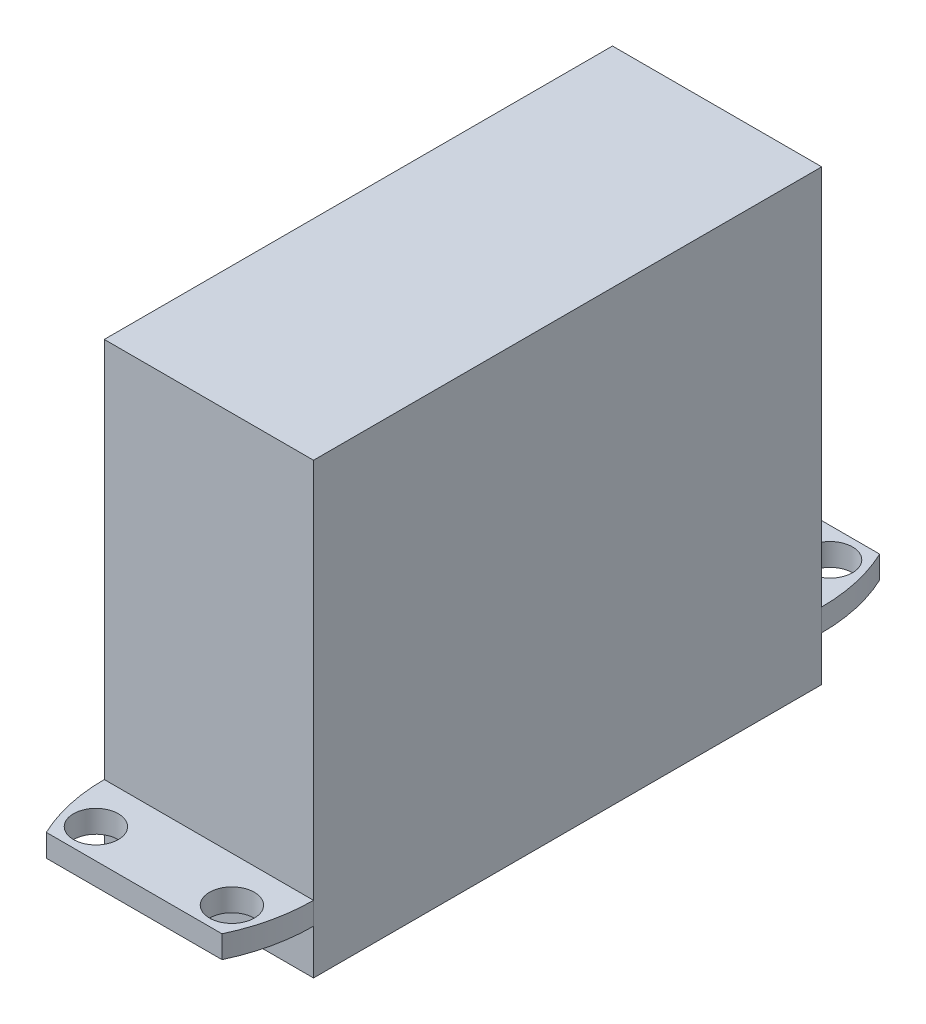
ISO-10303-21;
HEADER;
FILE_DESCRIPTION(('STEP AP214'),'2;1');
FILE_NAME('part.step','',(''),(''),'','','');
FILE_SCHEMA(('AUTOMOTIVE_DESIGN { 1 0 10303 214 1 1 1 1 }'));
ENDSEC;
DATA;
#1=APPLICATION_CONTEXT('core data for automotive mechanical design processes');
#2=APPLICATION_PROTOCOL_DEFINITION('international standard','automotive_design',2000,#1);
#3=PRODUCT_CONTEXT('',#1,'mechanical');
#4=PRODUCT('Part','Part','',(#3));
#5=PRODUCT_RELATED_PRODUCT_CATEGORY('part','',(#4));
#6=PRODUCT_DEFINITION_FORMATION('','',#4);
#7=PRODUCT_DEFINITION_CONTEXT('part definition',#1,'design');
#8=PRODUCT_DEFINITION('design','',#6,#7);
#9=PRODUCT_DEFINITION_SHAPE('','',#8);
#10=(LENGTH_UNIT() NAMED_UNIT(*) SI_UNIT(.MILLI.,.METRE.));
#11=(NAMED_UNIT(*) PLANE_ANGLE_UNIT() SI_UNIT($,.RADIAN.));
#12=(NAMED_UNIT(*) SI_UNIT($,.STERADIAN.) SOLID_ANGLE_UNIT());
#13=UNCERTAINTY_MEASURE_WITH_UNIT(LENGTH_MEASURE(1.E-05),#10,'distance_accuracy_value','');
#14=(GEOMETRIC_REPRESENTATION_CONTEXT(3) GLOBAL_UNCERTAINTY_ASSIGNED_CONTEXT((#13)) GLOBAL_UNIT_ASSIGNED_CONTEXT((#10,
#11,#12)) REPRESENTATION_CONTEXT('',''));
#15=CARTESIAN_POINT('',(0.,0.,0.));
#16=DIRECTION('',(0.,0.,1.));
#17=DIRECTION('',(1.,0.,0.));
#18=AXIS2_PLACEMENT_3D('',#15,#16,#17);
#19=CARTESIAN_POINT('',(0.,30.,-17.));
#20=DIRECTION('',(0.,0.,1.));
#21=DIRECTION('',(1.,0.,0.));
#22=AXIS2_PLACEMENT_3D('',#19,#20,#21);
#23=PLANE('',#22);
#24=DIRECTION('',(-1.,0.,0.));
#25=VECTOR('',#24,1.);
#26=CARTESIAN_POINT('',(0.,3.,-17.));
#27=LINE('',#26,#25);
#28=CARTESIAN_POINT('',(6.99999999999999,3.,-17.));
#29=VERTEX_POINT('',#28);
#30=CARTESIAN_POINT('',(-7.00000000000001,3.,-17.));
#31=VERTEX_POINT('',#30);
#32=EDGE_CURVE('E159',#29,#31,#27,.T.);
#33=ORIENTED_EDGE('',*,*,#32,.F.);
#34=DIRECTION('',(0.,-1.,0.));
#35=VECTOR('',#34,1.);
#36=CARTESIAN_POINT('',(6.99999999999999,30.,-17.));
#37=LINE('',#36,#35);
#38=CARTESIAN_POINT('',(6.99999999999999,0.,-17.));
#39=VERTEX_POINT('',#38);
#40=EDGE_CURVE('E249',#29,#39,#37,.T.);
#41=ORIENTED_EDGE('',*,*,#40,.T.);
#42=DIRECTION('',(-1.,0.,0.));
#43=VECTOR('',#42,1.);
#44=CARTESIAN_POINT('',(0.,0.,-17.));
#45=LINE('',#44,#43);
#46=CARTESIAN_POINT('',(-7.00000000000001,0.,-17.));
#47=VERTEX_POINT('',#46);
#48=EDGE_CURVE('E228',#39,#47,#45,.T.);
#49=ORIENTED_EDGE('',*,*,#48,.T.);
#50=DIRECTION('',(0.,-1.,0.));
#51=VECTOR('',#50,1.);
#52=CARTESIAN_POINT('',(-7.00000000000001,30.,-17.));
#53=LINE('',#52,#51);
#54=EDGE_CURVE('E235',#31,#47,#53,.T.);
#55=ORIENTED_EDGE('',*,*,#54,.F.);
#56=EDGE_LOOP('',(#33,#41,#49,#55));
#57=FACE_BOUND('',#56,.T.);
#58=ADVANCED_FACE('F38',(#57),#23,.F.);
#59=CARTESIAN_POINT('',(0.,30.,17.));
#60=DIRECTION('',(0.,0.,1.));
#61=DIRECTION('',(1.,0.,0.));
#62=AXIS2_PLACEMENT_3D('',#59,#60,#61);
#63=PLANE('',#62);
#64=DIRECTION('',(0.,-1.,0.));
#65=VECTOR('',#64,1.);
#66=CARTESIAN_POINT('',(6.99999999999999,30.,17.));
#67=LINE('',#66,#65);
#68=CARTESIAN_POINT('',(6.99999999999999,3.,17.));
#69=VERTEX_POINT('',#68);
#70=CARTESIAN_POINT('',(6.99999999999999,0.,17.));
#71=VERTEX_POINT('',#70);
#72=EDGE_CURVE('E252',#69,#71,#67,.T.);
#73=ORIENTED_EDGE('',*,*,#72,.F.);
#74=DIRECTION('',(-1.,0.,0.));
#75=VECTOR('',#74,1.);
#76=CARTESIAN_POINT('',(0.,3.,17.));
#77=LINE('',#76,#75);
#78=CARTESIAN_POINT('',(-7.00000000000001,3.,17.));
#79=VERTEX_POINT('',#78);
#80=EDGE_CURVE('E61',#69,#79,#77,.T.);
#81=ORIENTED_EDGE('',*,*,#80,.T.);
#82=DIRECTION('',(0.,-1.,0.));
#83=VECTOR('',#82,1.);
#84=CARTESIAN_POINT('',(-7.00000000000001,30.,17.));
#85=LINE('',#84,#83);
#86=CARTESIAN_POINT('',(-7.00000000000001,0.,17.));
#87=VERTEX_POINT('',#86);
#88=EDGE_CURVE('E46',#79,#87,#85,.T.);
#89=ORIENTED_EDGE('',*,*,#88,.T.);
#90=DIRECTION('',(-1.,0.,0.));
#91=VECTOR('',#90,1.);
#92=CARTESIAN_POINT('',(0.,0.,17.));
#93=LINE('',#92,#91);
#94=EDGE_CURVE('E238',#71,#87,#93,.T.);
#95=ORIENTED_EDGE('',*,*,#94,.F.);
#96=EDGE_LOOP('',(#73,#81,#89,#95));
#97=FACE_BOUND('',#96,.T.);
#98=ADVANCED_FACE('F265',(#97),#63,.T.);
#99=CARTESIAN_POINT('',(-7.00000000000001,30.,0.));
#100=DIRECTION('',(-1.,0.,0.));
#101=DIRECTION('',(0.,0.,1.));
#102=AXIS2_PLACEMENT_3D('',#99,#100,#101);
#103=PLANE('',#102);
#104=DIRECTION('',(0.,0.,-1.));
#105=VECTOR('',#104,1.);
#106=CARTESIAN_POINT('',(-7.00000000000001,0.,0.));
#107=LINE('',#106,#105);
#108=EDGE_CURVE('E221',#87,#47,#107,.T.);
#109=ORIENTED_EDGE('',*,*,#108,.F.);
#110=ORIENTED_EDGE('',*,*,#88,.F.);
#111=DIRECTION('',(0.,-1.,0.));
#112=VECTOR('',#111,1.);
#113=CARTESIAN_POINT('',(-7.00000000000001,4.5,17.));
#114=LINE('',#113,#112);
#115=CARTESIAN_POINT('',(-7.00000000000001,4.5,17.));
#116=VERTEX_POINT('',#115);
#117=EDGE_CURVE('E206',#116,#79,#114,.T.);
#118=ORIENTED_EDGE('',*,*,#117,.F.);
#119=CARTESIAN_POINT('',(-7.00000000000001,30.,17.));
#120=VERTEX_POINT('',#119);
#121=EDGE_CURVE('E11',#120,#116,#85,.T.);
#122=ORIENTED_EDGE('',*,*,#121,.F.);
#123=DIRECTION('',(0.,0.,-1.));
#124=VECTOR('',#123,1.);
#125=CARTESIAN_POINT('',(-7.00000000000001,30.,0.));
#126=LINE('',#125,#124);
#127=CARTESIAN_POINT('',(-7.00000000000001,30.,-17.));
#128=VERTEX_POINT('',#127);
#129=EDGE_CURVE('E224',#120,#128,#126,.T.);
#130=ORIENTED_EDGE('',*,*,#129,.T.);
#131=CARTESIAN_POINT('',(-7.00000000000001,4.5,-17.));
#132=VERTEX_POINT('',#131);
#133=EDGE_CURVE('E246',#128,#132,#53,.T.);
#134=ORIENTED_EDGE('',*,*,#133,.T.);
#135=DIRECTION('',(0.,-1.,0.));
#136=VECTOR('',#135,1.);
#137=CARTESIAN_POINT('',(-7.00000000000001,4.5,-17.));
#138=LINE('',#137,#136);
#139=EDGE_CURVE('E136',#132,#31,#138,.T.);
#140=ORIENTED_EDGE('',*,*,#139,.T.);
#141=ORIENTED_EDGE('',*,*,#54,.T.);
#142=EDGE_LOOP('',(#109,#110,#118,#122,#130,#134,#140,#141));
#143=FACE_BOUND('',#142,.T.);
#144=ADVANCED_FACE('F40',(#143),#103,.T.);
#145=DIRECTION('',(-1.,0.,0.));
#146=VECTOR('',#145,1.);
#147=CARTESIAN_POINT('',(0.,4.5,17.));
#148=LINE('',#147,#146);
#149=CARTESIAN_POINT('',(6.99999999999999,4.5,17.));
#150=VERTEX_POINT('',#149);
#151=EDGE_CURVE('E179',#150,#116,#148,.T.);
#152=ORIENTED_EDGE('',*,*,#151,.F.);
#153=CARTESIAN_POINT('',(6.99999999999999,30.,17.));
#154=VERTEX_POINT('',#153);
#155=EDGE_CURVE('E253',#154,#150,#67,.T.);
#156=ORIENTED_EDGE('',*,*,#155,.F.);
#157=DIRECTION('',(-1.,0.,0.));
#158=VECTOR('',#157,1.);
#159=CARTESIAN_POINT('',(0.,30.,17.));
#160=LINE('',#159,#158);
#161=EDGE_CURVE('E227',#154,#120,#160,.T.);
#162=ORIENTED_EDGE('',*,*,#161,.T.);
#163=ORIENTED_EDGE('',*,*,#121,.T.);
#164=EDGE_LOOP('',(#152,#156,#162,#163));
#165=FACE_BOUND('',#164,.T.);
#166=ADVANCED_FACE('F286',(#165),#63,.T.);
#167=CARTESIAN_POINT('',(6.99999999999999,30.,0.));
#168=DIRECTION('',(-1.,0.,0.));
#169=DIRECTION('',(0.,0.,1.));
#170=AXIS2_PLACEMENT_3D('',#167,#168,#169);
#171=PLANE('',#170);
#172=DIRECTION('',(0.,0.,-1.));
#173=VECTOR('',#172,1.);
#174=CARTESIAN_POINT('',(6.99999999999999,0.,0.));
#175=LINE('',#174,#173);
#176=EDGE_CURVE('E241',#71,#39,#175,.T.);
#177=ORIENTED_EDGE('',*,*,#176,.T.);
#178=ORIENTED_EDGE('',*,*,#40,.F.);
#179=DIRECTION('',(0.,-1.,0.));
#180=VECTOR('',#179,1.);
#181=CARTESIAN_POINT('',(6.99999999999999,4.5,-17.));
#182=LINE('',#181,#180);
#183=CARTESIAN_POINT('',(6.99999999999999,4.5,-17.));
#184=VERTEX_POINT('',#183);
#185=EDGE_CURVE('E171',#184,#29,#182,.T.);
#186=ORIENTED_EDGE('',*,*,#185,.F.);
#187=CARTESIAN_POINT('',(6.99999999999999,30.,-17.));
#188=VERTEX_POINT('',#187);
#189=EDGE_CURVE('E250',#188,#184,#37,.T.);
#190=ORIENTED_EDGE('',*,*,#189,.F.);
#191=DIRECTION('',(0.,0.,-1.));
#192=VECTOR('',#191,1.);
#193=CARTESIAN_POINT('',(6.99999999999999,30.,0.));
#194=LINE('',#193,#192);
#195=EDGE_CURVE('E231',#154,#188,#194,.T.);
#196=ORIENTED_EDGE('',*,*,#195,.F.);
#197=ORIENTED_EDGE('',*,*,#155,.T.);
#198=DIRECTION('',(0.,-1.,0.));
#199=VECTOR('',#198,1.);
#200=CARTESIAN_POINT('',(6.99999999999999,4.5,17.));
#201=LINE('',#200,#199);
#202=EDGE_CURVE('E193',#150,#69,#201,.T.);
#203=ORIENTED_EDGE('',*,*,#202,.T.);
#204=ORIENTED_EDGE('',*,*,#72,.T.);
#205=EDGE_LOOP('',(#177,#178,#186,#190,#196,#197,#203,#204));
#206=FACE_BOUND('',#205,.T.);
#207=ADVANCED_FACE('F258',(#206),#171,.F.);
#208=ORIENTED_EDGE('',*,*,#189,.T.);
#209=DIRECTION('',(-1.,0.,0.));
#210=VECTOR('',#209,1.);
#211=CARTESIAN_POINT('',(0.,4.5,-17.));
#212=LINE('',#211,#210);
#213=EDGE_CURVE('E146',#184,#132,#212,.T.);
#214=ORIENTED_EDGE('',*,*,#213,.T.);
#215=ORIENTED_EDGE('',*,*,#133,.F.);
#216=DIRECTION('',(-1.,0.,0.));
#217=VECTOR('',#216,1.);
#218=CARTESIAN_POINT('',(0.,30.,-17.));
#219=LINE('',#218,#217);
#220=EDGE_CURVE('E233',#188,#128,#219,.T.);
#221=ORIENTED_EDGE('',*,*,#220,.F.);
#222=EDGE_LOOP('',(#208,#214,#215,#221));
#223=FACE_BOUND('',#222,.T.);
#224=ADVANCED_FACE('F279',(#223),#23,.F.);
#225=CARTESIAN_POINT('',(0.,30.,0.));
#226=DIRECTION('',(0.,1.,0.));
#227=DIRECTION('',(0.,0.,1.));
#228=AXIS2_PLACEMENT_3D('',#225,#226,#227);
#229=PLANE('',#228);
#230=ORIENTED_EDGE('',*,*,#129,.F.);
#231=ORIENTED_EDGE('',*,*,#161,.F.);
#232=ORIENTED_EDGE('',*,*,#195,.T.);
#233=ORIENTED_EDGE('',*,*,#220,.T.);
#234=EDGE_LOOP('',(#230,#231,#232,#233));
#235=FACE_BOUND('',#234,.T.);
#236=ADVANCED_FACE('F283',(#235),#229,.T.);
#237=CARTESIAN_POINT('',(0.,0.,0.));
#238=DIRECTION('',(0.,1.,0.));
#239=DIRECTION('',(0.,0.,1.));
#240=AXIS2_PLACEMENT_3D('',#237,#238,#239);
#241=PLANE('',#240);
#242=CARTESIAN_POINT('',(0.,0.,9.99999999999997));
#243=DIRECTION('',(0.,1.,0.));
#244=DIRECTION('',(0.,0.,1.));
#245=AXIS2_PLACEMENT_3D('',#242,#243,#244);
#246=CIRCLE('',#245,2.5);
#247=CARTESIAN_POINT('',(0.,0.,12.5));
#248=VERTEX_POINT('',#247);
#249=EDGE_CURVE('E209',#248,#248,#246,.T.);
#250=ORIENTED_EDGE('',*,*,#249,.T.);
#251=EDGE_LOOP('',(#250));
#252=FACE_BOUND('',#251,.T.);
#253=ORIENTED_EDGE('',*,*,#108,.T.);
#254=ORIENTED_EDGE('',*,*,#48,.F.);
#255=ORIENTED_EDGE('',*,*,#176,.F.);
#256=ORIENTED_EDGE('',*,*,#94,.T.);
#257=EDGE_LOOP('',(#253,#254,#255,#256));
#258=FACE_BOUND('',#257,.T.);
#259=ADVANCED_FACE('F264',(#252,#258),#241,.F.);
#260=CARTESIAN_POINT('',(0.,12.,9.99999999999997));
#261=DIRECTION('',(0.,-1.,0.));
#262=DIRECTION('',(0.,0.,-1.));
#263=AXIS2_PLACEMENT_3D('',#260,#261,#262);
#264=CYLINDRICAL_SURFACE('',#263,2.5);
#265=CARTESIAN_POINT('',(0.,12.,9.99999999999997));
#266=DIRECTION('',(0.,1.,0.));
#267=DIRECTION('',(0.,0.,1.));
#268=AXIS2_PLACEMENT_3D('',#265,#266,#267);
#269=CIRCLE('',#268,2.5);
#270=CARTESIAN_POINT('',(0.,12.,12.5));
#271=VERTEX_POINT('',#270);
#272=EDGE_CURVE('E218',#271,#271,#269,.T.);
#273=ORIENTED_EDGE('',*,*,#272,.T.);
#274=EDGE_LOOP('',(#273));
#275=FACE_BOUND('',#274,.T.);
#276=ORIENTED_EDGE('',*,*,#249,.F.);
#277=EDGE_LOOP('',(#276));
#278=FACE_BOUND('',#277,.T.);
#279=ADVANCED_FACE('F511',(#275,#278),#264,.F.);
#280=CARTESIAN_POINT('',(0.,12.,9.99999999999997));
#281=DIRECTION('',(0.,1.,0.));
#282=DIRECTION('',(0.,0.,1.));
#283=AXIS2_PLACEMENT_3D('',#280,#281,#282);
#284=PLANE('',#283);
#285=ORIENTED_EDGE('',*,*,#272,.F.);
#286=EDGE_LOOP('',(#285));
#287=FACE_BOUND('',#286,.T.);
#288=ADVANCED_FACE('F314',(#287),#284,.F.);
#289=CARTESIAN_POINT('',(4.69999999999999,4.5,17.));
#290=DIRECTION('',(0.,-1.,0.));
#291=DIRECTION('',(0.,0.,-1.));
#292=AXIS2_PLACEMENT_3D('',#289,#290,#291);
#293=CYLINDRICAL_SURFACE('',#292,11.7);
#294=CARTESIAN_POINT('',(4.69999999999999,3.,17.));
#295=DIRECTION('',(0.,-1.,0.));
#296=DIRECTION('',(0.,0.,-1.));
#297=AXIS2_PLACEMENT_3D('',#294,#295,#296);
#298=CIRCLE('',#297,11.7);
#299=CARTESIAN_POINT('',(-5.87780695607554,3.,22.));
#300=VERTEX_POINT('',#299);
#301=EDGE_CURVE('E202',#79,#300,#298,.F.);
#302=ORIENTED_EDGE('',*,*,#301,.T.);
#303=DIRECTION('',(0.,-1.,0.));
#304=VECTOR('',#303,1.);
#305=CARTESIAN_POINT('',(-5.87780695607554,4.5,22.));
#306=LINE('',#305,#304);
#307=CARTESIAN_POINT('',(-5.87780695607554,4.5,22.));
#308=VERTEX_POINT('',#307);
#309=EDGE_CURVE('E210',#308,#300,#306,.T.);
#310=ORIENTED_EDGE('',*,*,#309,.F.);
#311=CARTESIAN_POINT('',(4.69999999999999,4.5,17.));
#312=DIRECTION('',(0.,-1.,0.));
#313=DIRECTION('',(0.,0.,-1.));
#314=AXIS2_PLACEMENT_3D('',#311,#312,#313);
#315=CIRCLE('',#314,11.7);
#316=EDGE_CURVE('E188',#116,#308,#315,.F.);
#317=ORIENTED_EDGE('',*,*,#316,.F.);
#318=ORIENTED_EDGE('',*,*,#117,.T.);
#319=EDGE_LOOP('',(#302,#310,#317,#318));
#320=FACE_BOUND('',#319,.T.);
#321=ADVANCED_FACE('F303',(#320),#293,.T.);
#322=CARTESIAN_POINT('',(0.,4.5,22.));
#323=DIRECTION('',(0.,0.,-1.));
#324=DIRECTION('',(-1.,0.,0.));
#325=AXIS2_PLACEMENT_3D('',#322,#323,#324);
#326=PLANE('',#325);
#327=DIRECTION('',(1.,0.,0.));
#328=VECTOR('',#327,1.);
#329=CARTESIAN_POINT('',(0.,3.,22.));
#330=LINE('',#329,#328);
#331=CARTESIAN_POINT('',(5.87780695607554,3.,22.));
#332=VERTEX_POINT('',#331);
#333=EDGE_CURVE('E200',#300,#332,#330,.T.);
#334=ORIENTED_EDGE('',*,*,#333,.T.);
#335=DIRECTION('',(0.,-1.,0.));
#336=VECTOR('',#335,1.);
#337=CARTESIAN_POINT('',(5.87780695607554,4.5,22.));
#338=LINE('',#337,#336);
#339=CARTESIAN_POINT('',(5.87780695607554,4.5,22.));
#340=VERTEX_POINT('',#339);
#341=EDGE_CURVE('E213',#340,#332,#338,.T.);
#342=ORIENTED_EDGE('',*,*,#341,.F.);
#343=DIRECTION('',(1.,0.,0.));
#344=VECTOR('',#343,1.);
#345=CARTESIAN_POINT('',(0.,4.5,22.));
#346=LINE('',#345,#344);
#347=EDGE_CURVE('E186',#308,#340,#346,.T.);
#348=ORIENTED_EDGE('',*,*,#347,.F.);
#349=ORIENTED_EDGE('',*,*,#309,.T.);
#350=EDGE_LOOP('',(#334,#342,#348,#349));
#351=FACE_BOUND('',#350,.T.);
#352=ADVANCED_FACE('F305',(#351),#326,.F.);
#353=CARTESIAN_POINT('',(-4.69999999999999,4.5,17.));
#354=DIRECTION('',(0.,-1.,0.));
#355=DIRECTION('',(0.,0.,-1.));
#356=AXIS2_PLACEMENT_3D('',#353,#354,#355);
#357=CYLINDRICAL_SURFACE('',#356,11.7);
#358=CARTESIAN_POINT('',(-4.69999999999999,3.,17.));
#359=DIRECTION('',(0.,-1.,0.));
#360=DIRECTION('',(0.,0.,-1.));
#361=AXIS2_PLACEMENT_3D('',#358,#359,#360);
#362=CIRCLE('',#361,11.7);
#363=EDGE_CURVE('E197',#332,#69,#362,.F.);
#364=ORIENTED_EDGE('',*,*,#363,.T.);
#365=ORIENTED_EDGE('',*,*,#202,.F.);
#366=CARTESIAN_POINT('',(-4.69999999999999,4.5,17.));
#367=DIRECTION('',(0.,-1.,0.));
#368=DIRECTION('',(0.,0.,-1.));
#369=AXIS2_PLACEMENT_3D('',#366,#367,#368);
#370=CIRCLE('',#369,11.7);
#371=EDGE_CURVE('E183',#340,#150,#370,.F.);
#372=ORIENTED_EDGE('',*,*,#371,.F.);
#373=ORIENTED_EDGE('',*,*,#341,.T.);
#374=EDGE_LOOP('',(#364,#365,#372,#373));
#375=FACE_BOUND('',#374,.T.);
#376=ADVANCED_FACE('F296',(#375),#357,.T.);
#377=CARTESIAN_POINT('',(-4.55000000000001,4.5,20.01));
#378=DIRECTION('',(0.,-1.,0.));
#379=DIRECTION('',(0.,0.,-1.));
#380=AXIS2_PLACEMENT_3D('',#377,#378,#379);
#381=CYLINDRICAL_SURFACE('',#380,1.5);
#382=CARTESIAN_POINT('',(-4.55000000000001,4.5,20.01));
#383=DIRECTION('',(0.,-1.,0.));
#384=DIRECTION('',(0.,0.,-1.));
#385=AXIS2_PLACEMENT_3D('',#382,#383,#384);
#386=CIRCLE('',#385,1.5);
#387=CARTESIAN_POINT('',(-4.55000000000001,4.5,18.51));
#388=VERTEX_POINT('',#387);
#389=EDGE_CURVE('E176',#388,#388,#386,.T.);
#390=ORIENTED_EDGE('',*,*,#389,.F.);
#391=EDGE_LOOP('',(#390));
#392=FACE_BOUND('',#391,.T.);
#393=CARTESIAN_POINT('',(-4.55000000000001,3.,20.01));
#394=DIRECTION('',(0.,-1.,0.));
#395=DIRECTION('',(0.,0.,-1.));
#396=AXIS2_PLACEMENT_3D('',#393,#394,#395);
#397=CIRCLE('',#396,1.5);
#398=CARTESIAN_POINT('',(-4.55000000000001,3.,18.51));
#399=VERTEX_POINT('',#398);
#400=EDGE_CURVE('E173',#399,#399,#397,.T.);
#401=ORIENTED_EDGE('',*,*,#400,.T.);
#402=EDGE_LOOP('',(#401));
#403=FACE_BOUND('',#402,.T.);
#404=ADVANCED_FACE('F312',(#392,#403),#381,.F.);
#405=CARTESIAN_POINT('',(4.55000000000001,4.5,20.01));
#406=DIRECTION('',(0.,-1.,0.));
#407=DIRECTION('',(0.,0.,-1.));
#408=AXIS2_PLACEMENT_3D('',#405,#406,#407);
#409=CYLINDRICAL_SURFACE('',#408,1.5);
#410=CARTESIAN_POINT('',(4.55000000000001,4.5,20.01));
#411=DIRECTION('',(0.,-1.,0.));
#412=DIRECTION('',(0.,0.,-1.));
#413=AXIS2_PLACEMENT_3D('',#410,#411,#412);
#414=CIRCLE('',#413,1.5);
#415=CARTESIAN_POINT('',(4.55000000000001,4.5,18.51));
#416=VERTEX_POINT('',#415);
#417=EDGE_CURVE('E190',#416,#416,#414,.F.);
#418=ORIENTED_EDGE('',*,*,#417,.T.);
#419=EDGE_LOOP('',(#418));
#420=FACE_BOUND('',#419,.T.);
#421=CARTESIAN_POINT('',(4.55000000000001,3.,20.01));
#422=DIRECTION('',(0.,-1.,0.));
#423=DIRECTION('',(0.,0.,-1.));
#424=AXIS2_PLACEMENT_3D('',#421,#422,#423);
#425=CIRCLE('',#424,1.5);
#426=CARTESIAN_POINT('',(4.55000000000001,3.,18.51));
#427=VERTEX_POINT('',#426);
#428=EDGE_CURVE('E180',#427,#427,#425,.F.);
#429=ORIENTED_EDGE('',*,*,#428,.F.);
#430=EDGE_LOOP('',(#429));
#431=FACE_BOUND('',#430,.T.);
#432=ADVANCED_FACE('F376',(#420,#431),#409,.F.);
#433=CARTESIAN_POINT('',(0.,4.5,0.));
#434=DIRECTION('',(0.,-1.,0.));
#435=DIRECTION('',(0.,0.,-1.));
#436=AXIS2_PLACEMENT_3D('',#433,#434,#435);
#437=PLANE('',#436);
#438=ORIENTED_EDGE('',*,*,#389,.T.);
#439=EDGE_LOOP('',(#438));
#440=FACE_BOUND('',#439,.T.);
#441=ORIENTED_EDGE('',*,*,#151,.T.);
#442=ORIENTED_EDGE('',*,*,#316,.T.);
#443=ORIENTED_EDGE('',*,*,#347,.T.);
#444=ORIENTED_EDGE('',*,*,#371,.T.);
#445=EDGE_LOOP('',(#441,#442,#443,#444));
#446=FACE_BOUND('',#445,.T.);
#447=ORIENTED_EDGE('',*,*,#417,.F.);
#448=EDGE_LOOP('',(#447));
#449=FACE_BOUND('',#448,.T.);
#450=ADVANCED_FACE('F288',(#440,#446,#449),#437,.F.);
#451=CARTESIAN_POINT('',(0.,3.,0.));
#452=DIRECTION('',(0.,-1.,0.));
#453=DIRECTION('',(0.,0.,-1.));
#454=AXIS2_PLACEMENT_3D('',#451,#452,#453);
#455=PLANE('',#454);
#456=ORIENTED_EDGE('',*,*,#400,.F.);
#457=EDGE_LOOP('',(#456));
#458=FACE_BOUND('',#457,.T.);
#459=ORIENTED_EDGE('',*,*,#80,.F.);
#460=ORIENTED_EDGE('',*,*,#363,.F.);
#461=ORIENTED_EDGE('',*,*,#333,.F.);
#462=ORIENTED_EDGE('',*,*,#301,.F.);
#463=EDGE_LOOP('',(#459,#460,#461,#462));
#464=FACE_BOUND('',#463,.T.);
#465=ORIENTED_EDGE('',*,*,#428,.T.);
#466=EDGE_LOOP('',(#465));
#467=FACE_BOUND('',#466,.T.);
#468=ADVANCED_FACE('F300',(#458,#464,#467),#455,.T.);
#469=CARTESIAN_POINT('',(-4.69999999999999,4.5,-17.));
#470=DIRECTION('',(0.,-1.,0.));
#471=DIRECTION('',(0.,0.,-1.));
#472=AXIS2_PLACEMENT_3D('',#469,#470,#471);
#473=CYLINDRICAL_SURFACE('',#472,11.7);
#474=CARTESIAN_POINT('',(-4.69999999999999,3.,-17.));
#475=DIRECTION('',(0.,1.,0.));
#476=DIRECTION('',(0.,0.,1.));
#477=AXIS2_PLACEMENT_3D('',#474,#475,#476);
#478=CIRCLE('',#477,11.7);
#479=CARTESIAN_POINT('',(5.87780695607554,3.,-22.));
#480=VERTEX_POINT('',#479);
#481=EDGE_CURVE('E165',#480,#29,#478,.F.);
#482=ORIENTED_EDGE('',*,*,#481,.F.);
#483=DIRECTION('',(0.,-1.,0.));
#484=VECTOR('',#483,1.);
#485=CARTESIAN_POINT('',(5.87780695607554,4.5,-22.));
#486=LINE('',#485,#484);
#487=CARTESIAN_POINT('',(5.87780695607554,4.5,-22.));
#488=VERTEX_POINT('',#487);
#489=EDGE_CURVE('E135',#488,#480,#486,.T.);
#490=ORIENTED_EDGE('',*,*,#489,.F.);
#491=CARTESIAN_POINT('',(-4.69999999999999,4.5,-17.));
#492=DIRECTION('',(0.,1.,0.));
#493=DIRECTION('',(0.,0.,1.));
#494=AXIS2_PLACEMENT_3D('',#491,#492,#493);
#495=CIRCLE('',#494,11.7);
#496=EDGE_CURVE('E141',#488,#184,#495,.F.);
#497=ORIENTED_EDGE('',*,*,#496,.T.);
#498=ORIENTED_EDGE('',*,*,#185,.T.);
#499=EDGE_LOOP('',(#482,#490,#497,#498));
#500=FACE_BOUND('',#499,.T.);
#501=ADVANCED_FACE('F405',(#500),#473,.T.);
#502=CARTESIAN_POINT('',(0.,4.5,-22.));
#503=DIRECTION('',(0.,0.,-1.));
#504=DIRECTION('',(-1.,0.,0.));
#505=AXIS2_PLACEMENT_3D('',#502,#503,#504);
#506=PLANE('',#505);
#507=DIRECTION('',(1.,0.,0.));
#508=VECTOR('',#507,1.);
#509=CARTESIAN_POINT('',(0.,3.,-22.));
#510=LINE('',#509,#508);
#511=CARTESIAN_POINT('',(-5.87780695607554,3.,-22.));
#512=VERTEX_POINT('',#511);
#513=EDGE_CURVE('E132',#512,#480,#510,.T.);
#514=ORIENTED_EDGE('',*,*,#513,.F.);
#515=DIRECTION('',(0.,-1.,0.));
#516=VECTOR('',#515,1.);
#517=CARTESIAN_POINT('',(-5.87780695607554,4.5,-22.));
#518=LINE('',#517,#516);
#519=CARTESIAN_POINT('',(-5.87780695607554,4.5,-22.));
#520=VERTEX_POINT('',#519);
#521=EDGE_CURVE('E127',#520,#512,#518,.T.);
#522=ORIENTED_EDGE('',*,*,#521,.F.);
#523=DIRECTION('',(1.,0.,0.));
#524=VECTOR('',#523,1.);
#525=CARTESIAN_POINT('',(0.,4.5,-22.));
#526=LINE('',#525,#524);
#527=EDGE_CURVE('E129',#520,#488,#526,.T.);
#528=ORIENTED_EDGE('',*,*,#527,.T.);
#529=ORIENTED_EDGE('',*,*,#489,.T.);
#530=EDGE_LOOP('',(#514,#522,#528,#529));
#531=FACE_BOUND('',#530,.T.);
#532=ADVANCED_FACE('F128',(#531),#506,.T.);
#533=CARTESIAN_POINT('',(4.69999999999999,4.5,-17.));
#534=DIRECTION('',(0.,-1.,0.));
#535=DIRECTION('',(0.,0.,-1.));
#536=AXIS2_PLACEMENT_3D('',#533,#534,#535);
#537=CYLINDRICAL_SURFACE('',#536,11.7);
#538=CARTESIAN_POINT('',(4.69999999999999,3.,-17.));
#539=DIRECTION('',(0.,1.,0.));
#540=DIRECTION('',(0.,0.,1.));
#541=AXIS2_PLACEMENT_3D('',#538,#539,#540);
#542=CIRCLE('',#541,11.7);
#543=EDGE_CURVE('E162',#31,#512,#542,.F.);
#544=ORIENTED_EDGE('',*,*,#543,.F.);
#545=ORIENTED_EDGE('',*,*,#139,.F.);
#546=CARTESIAN_POINT('',(4.69999999999999,4.5,-17.));
#547=DIRECTION('',(0.,1.,0.));
#548=DIRECTION('',(0.,0.,1.));
#549=AXIS2_PLACEMENT_3D('',#546,#547,#548);
#550=CIRCLE('',#549,11.7);
#551=EDGE_CURVE('E53',#132,#520,#550,.F.);
#552=ORIENTED_EDGE('',*,*,#551,.T.);
#553=ORIENTED_EDGE('',*,*,#521,.T.);
#554=EDGE_LOOP('',(#544,#545,#552,#553));
#555=FACE_BOUND('',#554,.T.);
#556=ADVANCED_FACE('F143',(#555),#537,.T.);
#557=CARTESIAN_POINT('',(-4.55000000000001,4.5,-20.01));
#558=DIRECTION('',(0.,-1.,0.));
#559=DIRECTION('',(0.,0.,-1.));
#560=AXIS2_PLACEMENT_3D('',#557,#558,#559);
#561=CYLINDRICAL_SURFACE('',#560,1.5);
#562=CARTESIAN_POINT('',(-4.55000000000001,4.5,-20.01));
#563=DIRECTION('',(0.,1.,0.));
#564=DIRECTION('',(0.,0.,1.));
#565=AXIS2_PLACEMENT_3D('',#562,#563,#564);
#566=CIRCLE('',#565,1.5);
#567=CARTESIAN_POINT('',(-4.55000000000001,4.5,-18.51));
#568=VERTEX_POINT('',#567);
#569=EDGE_CURVE('E148',#568,#568,#566,.T.);
#570=ORIENTED_EDGE('',*,*,#569,.T.);
#571=EDGE_LOOP('',(#570));
#572=FACE_BOUND('',#571,.T.);
#573=CARTESIAN_POINT('',(-4.55000000000001,3.,-20.01));
#574=DIRECTION('',(0.,1.,0.));
#575=DIRECTION('',(0.,0.,1.));
#576=AXIS2_PLACEMENT_3D('',#573,#574,#575);
#577=CIRCLE('',#576,1.5);
#578=CARTESIAN_POINT('',(-4.55000000000001,3.,-18.51));
#579=VERTEX_POINT('',#578);
#580=EDGE_CURVE('E156',#579,#579,#577,.T.);
#581=ORIENTED_EDGE('',*,*,#580,.F.);
#582=EDGE_LOOP('',(#581));
#583=FACE_BOUND('',#582,.T.);
#584=ADVANCED_FACE('F435',(#572,#583),#561,.F.);
#585=CARTESIAN_POINT('',(4.55000000000001,4.5,-20.01));
#586=DIRECTION('',(0.,-1.,0.));
#587=DIRECTION('',(0.,0.,-1.));
#588=AXIS2_PLACEMENT_3D('',#585,#586,#587);
#589=CYLINDRICAL_SURFACE('',#588,1.5);
#590=CARTESIAN_POINT('',(4.55000000000001,4.5,-20.01));
#591=DIRECTION('',(0.,1.,0.));
#592=DIRECTION('',(0.,0.,1.));
#593=AXIS2_PLACEMENT_3D('',#590,#591,#592);
#594=CIRCLE('',#593,1.5);
#595=CARTESIAN_POINT('',(4.55000000000001,4.5,-18.51));
#596=VERTEX_POINT('',#595);
#597=EDGE_CURVE('E153',#596,#596,#594,.F.);
#598=ORIENTED_EDGE('',*,*,#597,.F.);
#599=EDGE_LOOP('',(#598));
#600=FACE_BOUND('',#599,.T.);
#601=CARTESIAN_POINT('',(4.55000000000001,3.,-20.01));
#602=DIRECTION('',(0.,1.,0.));
#603=DIRECTION('',(0.,0.,1.));
#604=AXIS2_PLACEMENT_3D('',#601,#602,#603);
#605=CIRCLE('',#604,1.5);
#606=CARTESIAN_POINT('',(4.55000000000001,3.,-18.51));
#607=VERTEX_POINT('',#606);
#608=EDGE_CURVE('E168',#607,#607,#605,.F.);
#609=ORIENTED_EDGE('',*,*,#608,.T.);
#610=EDGE_LOOP('',(#609));
#611=FACE_BOUND('',#610,.T.);
#612=ADVANCED_FACE('F443',(#600,#611),#589,.F.);
#613=CARTESIAN_POINT('',(0.,4.5,0.));
#614=DIRECTION('',(0.,-1.,0.));
#615=DIRECTION('',(0.,0.,1.));
#616=AXIS2_PLACEMENT_3D('',#613,#614,#615);
#617=PLANE('',#616);
#618=ORIENTED_EDGE('',*,*,#569,.F.);
#619=EDGE_LOOP('',(#618));
#620=FACE_BOUND('',#619,.T.);
#621=ORIENTED_EDGE('',*,*,#213,.F.);
#622=ORIENTED_EDGE('',*,*,#496,.F.);
#623=ORIENTED_EDGE('',*,*,#527,.F.);
#624=ORIENTED_EDGE('',*,*,#551,.F.);
#625=EDGE_LOOP('',(#621,#622,#623,#624));
#626=FACE_BOUND('',#625,.T.);
#627=ORIENTED_EDGE('',*,*,#597,.T.);
#628=EDGE_LOOP('',(#627));
#629=FACE_BOUND('',#628,.T.);
#630=ADVANCED_FACE('F138',(#620,#626,#629),#617,.F.);
#631=CARTESIAN_POINT('',(0.,3.,0.));
#632=DIRECTION('',(0.,-1.,0.));
#633=DIRECTION('',(0.,0.,1.));
#634=AXIS2_PLACEMENT_3D('',#631,#632,#633);
#635=PLANE('',#634);
#636=ORIENTED_EDGE('',*,*,#580,.T.);
#637=EDGE_LOOP('',(#636));
#638=FACE_BOUND('',#637,.T.);
#639=ORIENTED_EDGE('',*,*,#32,.T.);
#640=ORIENTED_EDGE('',*,*,#543,.T.);
#641=ORIENTED_EDGE('',*,*,#513,.T.);
#642=ORIENTED_EDGE('',*,*,#481,.T.);
#643=EDGE_LOOP('',(#639,#640,#641,#642));
#644=FACE_BOUND('',#643,.T.);
#645=ORIENTED_EDGE('',*,*,#608,.F.);
#646=EDGE_LOOP('',(#645));
#647=FACE_BOUND('',#646,.T.);
#648=ADVANCED_FACE('F460',(#638,#644,#647),#635,.T.);
#649=CLOSED_SHELL('',(#58,#98,#144,#166,#207,#224,#236,#259,#279,#288,#321,#352,#376,#404,#432,
#450,#468,#501,#532,#556,#584,#612,#630,#648));
#650=MANIFOLD_SOLID_BREP('B2',#649);
#651=ADVANCED_BREP_SHAPE_REPRESENTATION('',(#18,#650),#14);
#652=SHAPE_DEFINITION_REPRESENTATION(#9,#651);
ENDSEC;
END-ISO-10303-21;
